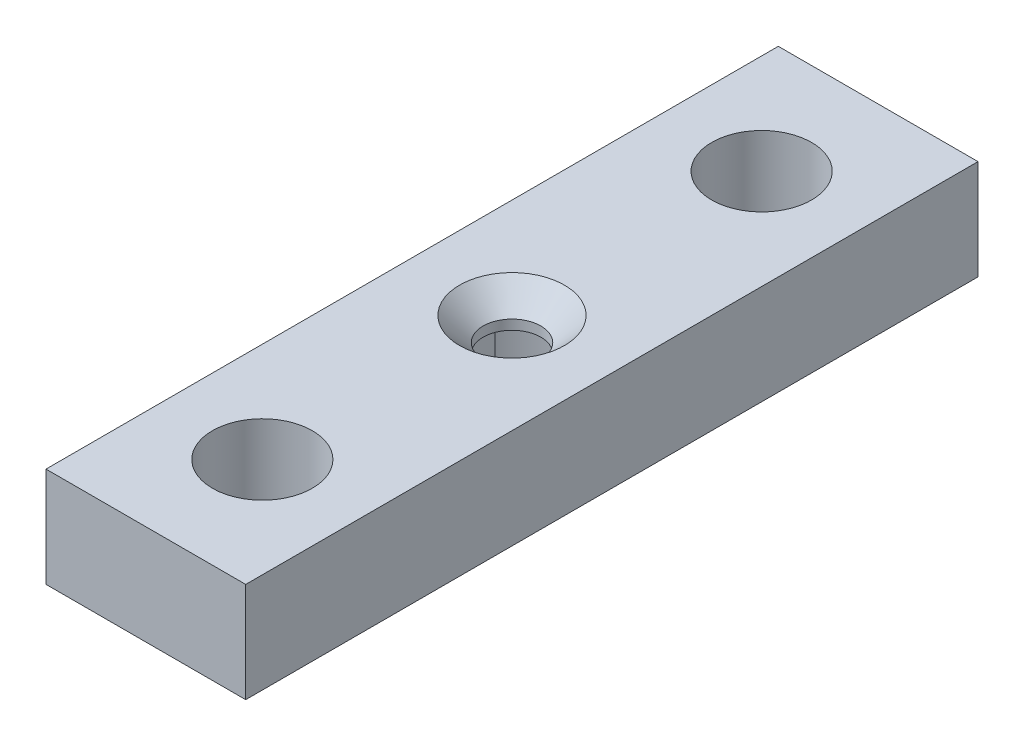
ISO-10303-21;
HEADER;
FILE_DESCRIPTION(('STEP AP214'),'2;1');
FILE_NAME('part.step','',(''),(''),'','','');
FILE_SCHEMA(('AUTOMOTIVE_DESIGN { 1 0 10303 214 1 1 1 1 }'));
ENDSEC;
DATA;
#1=APPLICATION_CONTEXT('core data for automotive mechanical design processes');
#2=APPLICATION_PROTOCOL_DEFINITION('international standard','automotive_design',2000,#1);
#3=PRODUCT_CONTEXT('',#1,'mechanical');
#4=PRODUCT('Part','Part','',(#3));
#5=PRODUCT_RELATED_PRODUCT_CATEGORY('part','',(#4));
#6=PRODUCT_DEFINITION_FORMATION('','',#4);
#7=PRODUCT_DEFINITION_CONTEXT('part definition',#1,'design');
#8=PRODUCT_DEFINITION('design','',#6,#7);
#9=PRODUCT_DEFINITION_SHAPE('','',#8);
#10=(LENGTH_UNIT() NAMED_UNIT(*) SI_UNIT(.MILLI.,.METRE.));
#11=(NAMED_UNIT(*) PLANE_ANGLE_UNIT() SI_UNIT($,.RADIAN.));
#12=(NAMED_UNIT(*) SI_UNIT($,.STERADIAN.) SOLID_ANGLE_UNIT());
#13=UNCERTAINTY_MEASURE_WITH_UNIT(LENGTH_MEASURE(1.E-05),#10,'distance_accuracy_value','');
#14=(GEOMETRIC_REPRESENTATION_CONTEXT(3) GLOBAL_UNCERTAINTY_ASSIGNED_CONTEXT((#13)) GLOBAL_UNIT_ASSIGNED_CONTEXT((#10,
#11,#12)) REPRESENTATION_CONTEXT('',''));
#15=CARTESIAN_POINT('',(0.,0.,0.));
#16=DIRECTION('',(0.,0.,1.));
#17=DIRECTION('',(1.,0.,0.));
#18=AXIS2_PLACEMENT_3D('',#15,#16,#17);
#19=CARTESIAN_POINT('',(0.,3.175,0.));
#20=DIRECTION('',(0.,-1.,0.));
#21=DIRECTION('',(0.,0.,-1.));
#22=AXIS2_PLACEMENT_3D('',#19,#20,#21);
#23=CYLINDRICAL_SURFACE('',#22,15.9385);
#24=CARTESIAN_POINT('',(0.,-9.525,0.));
#25=DIRECTION('',(0.,-1.,0.));
#26=DIRECTION('',(0.,0.,-1.));
#27=AXIS2_PLACEMENT_3D('',#24,#25,#26);
#28=CIRCLE('',#27,15.9385);
#29=CARTESIAN_POINT('',(-12.7635,-9.525,-9.54614320026679));
#30=VERTEX_POINT('',#29);
#31=CARTESIAN_POINT('',(12.7635,-9.525,-9.54614320026679));
#32=VERTEX_POINT('',#31);
#33=EDGE_CURVE('E112',#30,#32,#28,.T.);
#34=ORIENTED_EDGE('',*,*,#33,.T.);
#35=DIRECTION('',(0.,-1.,0.));
#36=VECTOR('',#35,1.);
#37=CARTESIAN_POINT('',(12.7635,22.5294833307428,-9.54614320026679));
#38=LINE('',#37,#36);
#39=CARTESIAN_POINT('',(12.7635,3.175,-9.54614320026679));
#40=VERTEX_POINT('',#39);
#41=EDGE_CURVE('E58',#40,#32,#38,.T.);
#42=ORIENTED_EDGE('',*,*,#41,.F.);
#43=CARTESIAN_POINT('',(0.,3.175,0.));
#44=DIRECTION('',(0.,-1.,0.));
#45=DIRECTION('',(0.,0.,-1.));
#46=AXIS2_PLACEMENT_3D('',#43,#44,#45);
#47=CIRCLE('',#46,15.9385);
#48=CARTESIAN_POINT('',(-12.7635,3.175,-9.54614320026679));
#49=VERTEX_POINT('',#48);
#50=EDGE_CURVE('E133',#49,#40,#47,.T.);
#51=ORIENTED_EDGE('',*,*,#50,.F.);
#52=DIRECTION('',(0.,-1.,0.));
#53=VECTOR('',#52,1.);
#54=CARTESIAN_POINT('',(-12.7635,22.5294833307428,-9.54614320026679));
#55=LINE('',#54,#53);
#56=EDGE_CURVE('E127',#49,#30,#55,.T.);
#57=ORIENTED_EDGE('',*,*,#56,.T.);
#58=EDGE_LOOP('',(#34,#42,#51,#57));
#59=FACE_BOUND('',#58,.T.);
#60=ADVANCED_FACE('F34',(#59),#23,.F.);
#61=CARTESIAN_POINT('',(0.,9.525,0.));
#62=DIRECTION('',(0.,1.,0.));
#63=DIRECTION('',(0.,0.,1.));
#64=AXIS2_PLACEMENT_3D('',#61,#62,#63);
#65=CYLINDRICAL_SURFACE('',#64,5.49999999999999);
#66=CARTESIAN_POINT('',(0.,5.025,0.));
#67=DIRECTION('',(0.,1.,0.));
#68=DIRECTION('',(0.,0.,1.));
#69=AXIS2_PLACEMENT_3D('',#66,#67,#68);
#70=CIRCLE('',#69,5.5);
#71=CARTESIAN_POINT('',(0.,5.025,5.5));
#72=VERTEX_POINT('',#71);
#73=EDGE_CURVE('E138',#72,#72,#70,.T.);
#74=ORIENTED_EDGE('',*,*,#73,.T.);
#75=EDGE_LOOP('',(#74));
#76=FACE_BOUND('',#75,.T.);
#77=CARTESIAN_POINT('',(0.,3.175,0.));
#78=DIRECTION('',(0.,-1.,0.));
#79=DIRECTION('',(0.,0.,-1.));
#80=AXIS2_PLACEMENT_3D('',#77,#78,#79);
#81=CIRCLE('',#80,5.49999999999999);
#82=CARTESIAN_POINT('',(0.,3.175,-5.49999999999999));
#83=VERTEX_POINT('',#82);
#84=EDGE_CURVE('E38',#83,#83,#81,.F.);
#85=ORIENTED_EDGE('',*,*,#84,.F.);
#86=EDGE_LOOP('',(#85));
#87=FACE_BOUND('',#86,.T.);
#88=ADVANCED_FACE('F205',(#76,#87),#65,.F.);
#89=CARTESIAN_POINT('',(19.05,9.525,69.85));
#90=DIRECTION('',(-1.,0.,0.));
#91=DIRECTION('',(0.,-1.,0.));
#92=AXIS2_PLACEMENT_3D('',#89,#90,#91);
#93=PLANE('',#92);
#94=DIRECTION('',(0.,1.,0.));
#95=VECTOR('',#94,1.);
#96=CARTESIAN_POINT('',(19.05,9.525,-69.85));
#97=LINE('',#96,#95);
#98=CARTESIAN_POINT('',(19.05,-9.525,-69.85));
#99=VERTEX_POINT('',#98);
#100=CARTESIAN_POINT('',(19.05,9.525,-69.85));
#101=VERTEX_POINT('',#100);
#102=EDGE_CURVE('E149',#99,#101,#97,.T.);
#103=ORIENTED_EDGE('',*,*,#102,.T.);
#104=DIRECTION('',(0.,0.,-1.));
#105=VECTOR('',#104,1.);
#106=CARTESIAN_POINT('',(19.05,9.525,69.85));
#107=LINE('',#106,#105);
#108=CARTESIAN_POINT('',(19.05,9.525,69.85));
#109=VERTEX_POINT('',#108);
#110=EDGE_CURVE('E11',#109,#101,#107,.T.);
#111=ORIENTED_EDGE('',*,*,#110,.F.);
#112=DIRECTION('',(0.,1.,0.));
#113=VECTOR('',#112,1.);
#114=CARTESIAN_POINT('',(19.05,9.525,69.85));
#115=LINE('',#114,#113);
#116=CARTESIAN_POINT('',(19.05,-9.525,69.85));
#117=VERTEX_POINT('',#116);
#118=EDGE_CURVE('E154',#117,#109,#115,.T.);
#119=ORIENTED_EDGE('',*,*,#118,.F.);
#120=DIRECTION('',(0.,0.,-1.));
#121=VECTOR('',#120,1.);
#122=CARTESIAN_POINT('',(19.05,-9.525,69.85));
#123=LINE('',#122,#121);
#124=EDGE_CURVE('E164',#117,#99,#123,.T.);
#125=ORIENTED_EDGE('',*,*,#124,.T.);
#126=EDGE_LOOP('',(#103,#111,#119,#125));
#127=FACE_BOUND('',#126,.T.);
#128=ADVANCED_FACE('F36',(#127),#93,.F.);
#129=CARTESIAN_POINT('',(-19.05,9.525,69.85));
#130=DIRECTION('',(0.,-1.,0.));
#131=DIRECTION('',(0.,0.,-1.));
#132=AXIS2_PLACEMENT_3D('',#129,#130,#131);
#133=PLANE('',#132);
#134=CARTESIAN_POINT('',(0.,9.525,0.));
#135=DIRECTION('',(0.,1.,0.));
#136=DIRECTION('',(0.,0.,1.));
#137=AXIS2_PLACEMENT_3D('',#134,#135,#136);
#138=CIRCLE('',#137,10.);
#139=CARTESIAN_POINT('',(0.,9.525,10.));
#140=VERTEX_POINT('',#139);
#141=EDGE_CURVE('E135',#140,#140,#138,.T.);
#142=ORIENTED_EDGE('',*,*,#141,.F.);
#143=EDGE_LOOP('',(#142));
#144=FACE_BOUND('',#143,.T.);
#145=CARTESIAN_POINT('',(0.,9.525,-47.625));
#146=DIRECTION('',(0.,1.,0.));
#147=DIRECTION('',(0.,0.,1.));
#148=AXIS2_PLACEMENT_3D('',#145,#146,#147);
#149=CIRCLE('',#148,9.525);
#150=CARTESIAN_POINT('',(0.,9.525,-38.1));
#151=VERTEX_POINT('',#150);
#152=EDGE_CURVE('E142',#151,#151,#149,.T.);
#153=ORIENTED_EDGE('',*,*,#152,.F.);
#154=EDGE_LOOP('',(#153));
#155=FACE_BOUND('',#154,.T.);
#156=CARTESIAN_POINT('',(0.,9.525,47.625));
#157=DIRECTION('',(0.,1.,0.));
#158=DIRECTION('',(0.,0.,1.));
#159=AXIS2_PLACEMENT_3D('',#156,#157,#158);
#160=CIRCLE('',#159,9.525);
#161=CARTESIAN_POINT('',(0.,9.525,57.15));
#162=VERTEX_POINT('',#161);
#163=EDGE_CURVE('E141',#162,#162,#160,.T.);
#164=ORIENTED_EDGE('',*,*,#163,.F.);
#165=EDGE_LOOP('',(#164));
#166=FACE_BOUND('',#165,.T.);
#167=DIRECTION('',(-1.,0.,0.));
#168=VECTOR('',#167,1.);
#169=CARTESIAN_POINT('',(-19.05,9.525,-69.85));
#170=LINE('',#169,#168);
#171=CARTESIAN_POINT('',(-19.05,9.525,-69.85));
#172=VERTEX_POINT('',#171);
#173=EDGE_CURVE('E167',#101,#172,#170,.T.);
#174=ORIENTED_EDGE('',*,*,#173,.T.);
#175=DIRECTION('',(0.,0.,-1.));
#176=VECTOR('',#175,1.);
#177=CARTESIAN_POINT('',(-19.05,9.525,69.85));
#178=LINE('',#177,#176);
#179=CARTESIAN_POINT('',(-19.05,9.525,69.85));
#180=VERTEX_POINT('',#179);
#181=EDGE_CURVE('E43',#180,#172,#178,.T.);
#182=ORIENTED_EDGE('',*,*,#181,.F.);
#183=DIRECTION('',(-1.,0.,0.));
#184=VECTOR('',#183,1.);
#185=CARTESIAN_POINT('',(-19.05,9.525,69.85));
#186=LINE('',#185,#184);
#187=EDGE_CURVE('E157',#109,#180,#186,.T.);
#188=ORIENTED_EDGE('',*,*,#187,.F.);
#189=ORIENTED_EDGE('',*,*,#110,.T.);
#190=EDGE_LOOP('',(#174,#182,#188,#189));
#191=FACE_BOUND('',#190,.T.);
#192=ADVANCED_FACE('F197',(#144,#155,#166,#191),#133,.F.);
#193=CARTESIAN_POINT('',(-19.05,9.525,69.85));
#194=DIRECTION('',(1.,0.,0.));
#195=DIRECTION('',(0.,1.,0.));
#196=AXIS2_PLACEMENT_3D('',#193,#194,#195);
#197=PLANE('',#196);
#198=DIRECTION('',(0.,-1.,0.));
#199=VECTOR('',#198,1.);
#200=CARTESIAN_POINT('',(-19.05,9.525,-69.85));
#201=LINE('',#200,#199);
#202=CARTESIAN_POINT('',(-19.05,-9.525,-69.85));
#203=VERTEX_POINT('',#202);
#204=EDGE_CURVE('E169',#172,#203,#201,.T.);
#205=ORIENTED_EDGE('',*,*,#204,.T.);
#206=DIRECTION('',(0.,0.,-1.));
#207=VECTOR('',#206,1.);
#208=CARTESIAN_POINT('',(-19.05,-9.525,69.85));
#209=LINE('',#208,#207);
#210=CARTESIAN_POINT('',(-19.05,-9.525,69.85));
#211=VERTEX_POINT('',#210);
#212=EDGE_CURVE('E174',#211,#203,#209,.T.);
#213=ORIENTED_EDGE('',*,*,#212,.F.);
#214=DIRECTION('',(0.,-1.,0.));
#215=VECTOR('',#214,1.);
#216=CARTESIAN_POINT('',(-19.05,9.525,69.85));
#217=LINE('',#216,#215);
#218=EDGE_CURVE('E160',#180,#211,#217,.T.);
#219=ORIENTED_EDGE('',*,*,#218,.F.);
#220=ORIENTED_EDGE('',*,*,#181,.T.);
#221=EDGE_LOOP('',(#205,#213,#219,#220));
#222=FACE_BOUND('',#221,.T.);
#223=ADVANCED_FACE('F182',(#222),#197,.F.);
#224=CARTESIAN_POINT('',(-19.05,-9.525,69.85));
#225=DIRECTION('',(0.,1.,0.));
#226=DIRECTION('',(0.,0.,1.));
#227=AXIS2_PLACEMENT_3D('',#224,#225,#226);
#228=PLANE('',#227);
#229=ORIENTED_EDGE('',*,*,#33,.F.);
#230=DIRECTION('',(0.,0.,1.));
#231=VECTOR('',#230,1.);
#232=CARTESIAN_POINT('',(-12.7635,-9.525,9.54614320026679));
#233=LINE('',#232,#231);
#234=CARTESIAN_POINT('',(-12.7635,-9.525,9.54614320026679));
#235=VERTEX_POINT('',#234);
#236=EDGE_CURVE('E108',#30,#235,#233,.T.);
#237=ORIENTED_EDGE('',*,*,#236,.T.);
#238=CARTESIAN_POINT('',(12.7635,-9.525,9.54614320026679));
#239=VERTEX_POINT('',#238);
#240=EDGE_CURVE('E101',#239,#235,#28,.T.);
#241=ORIENTED_EDGE('',*,*,#240,.F.);
#242=DIRECTION('',(0.,0.,-1.));
#243=VECTOR('',#242,1.);
#244=CARTESIAN_POINT('',(12.7635,-9.525,9.54614320026679));
#245=LINE('',#244,#243);
#246=EDGE_CURVE('E106',#239,#32,#245,.T.);
#247=ORIENTED_EDGE('',*,*,#246,.T.);
#248=EDGE_LOOP('',(#229,#237,#241,#247));
#249=FACE_BOUND('',#248,.T.);
#250=CARTESIAN_POINT('',(0.,-9.525,-47.625));
#251=DIRECTION('',(0.,1.,0.));
#252=DIRECTION('',(0.,0.,1.));
#253=AXIS2_PLACEMENT_3D('',#250,#251,#252);
#254=CIRCLE('',#253,9.525);
#255=CARTESIAN_POINT('',(0.,-9.525,-38.1));
#256=VERTEX_POINT('',#255);
#257=EDGE_CURVE('E145',#256,#256,#254,.F.);
#258=ORIENTED_EDGE('',*,*,#257,.F.);
#259=EDGE_LOOP('',(#258));
#260=FACE_BOUND('',#259,.T.);
#261=CARTESIAN_POINT('',(0.,-9.525,47.625));
#262=DIRECTION('',(0.,1.,0.));
#263=DIRECTION('',(0.,0.,1.));
#264=AXIS2_PLACEMENT_3D('',#261,#262,#263);
#265=CIRCLE('',#264,9.525);
#266=CARTESIAN_POINT('',(0.,-9.525,57.15));
#267=VERTEX_POINT('',#266);
#268=EDGE_CURVE('E146',#267,#267,#265,.F.);
#269=ORIENTED_EDGE('',*,*,#268,.F.);
#270=EDGE_LOOP('',(#269));
#271=FACE_BOUND('',#270,.T.);
#272=DIRECTION('',(1.,0.,0.));
#273=VECTOR('',#272,1.);
#274=CARTESIAN_POINT('',(-19.05,-9.525,-69.85));
#275=LINE('',#274,#273);
#276=EDGE_CURVE('E158',#203,#99,#275,.T.);
#277=ORIENTED_EDGE('',*,*,#276,.T.);
#278=ORIENTED_EDGE('',*,*,#124,.F.);
#279=DIRECTION('',(1.,0.,0.));
#280=VECTOR('',#279,1.);
#281=CARTESIAN_POINT('',(-19.05,-9.525,69.85));
#282=LINE('',#281,#280);
#283=EDGE_CURVE('E162',#211,#117,#282,.T.);
#284=ORIENTED_EDGE('',*,*,#283,.F.);
#285=ORIENTED_EDGE('',*,*,#212,.T.);
#286=EDGE_LOOP('',(#277,#278,#284,#285));
#287=FACE_BOUND('',#286,.T.);
#288=ADVANCED_FACE('F103',(#249,#260,#271,#287),#228,.F.);
#289=CARTESIAN_POINT('',(19.05,-9.525,69.85));
#290=DIRECTION('',(0.,0.,1.));
#291=DIRECTION('',(1.,0.,0.));
#292=AXIS2_PLACEMENT_3D('',#289,#290,#291);
#293=PLANE('',#292);
#294=ORIENTED_EDGE('',*,*,#118,.T.);
#295=ORIENTED_EDGE('',*,*,#187,.T.);
#296=ORIENTED_EDGE('',*,*,#218,.T.);
#297=ORIENTED_EDGE('',*,*,#283,.T.);
#298=EDGE_LOOP('',(#294,#295,#296,#297));
#299=FACE_BOUND('',#298,.T.);
#300=ADVANCED_FACE('F196',(#299),#293,.T.);
#301=CARTESIAN_POINT('',(19.05,-9.525,-69.85));
#302=DIRECTION('',(0.,0.,1.));
#303=DIRECTION('',(1.,0.,0.));
#304=AXIS2_PLACEMENT_3D('',#301,#302,#303);
#305=PLANE('',#304);
#306=ORIENTED_EDGE('',*,*,#102,.F.);
#307=ORIENTED_EDGE('',*,*,#276,.F.);
#308=ORIENTED_EDGE('',*,*,#204,.F.);
#309=ORIENTED_EDGE('',*,*,#173,.F.);
#310=EDGE_LOOP('',(#306,#307,#308,#309));
#311=FACE_BOUND('',#310,.T.);
#312=ADVANCED_FACE('F188',(#311),#305,.F.);
#313=CARTESIAN_POINT('',(0.,-9.526,47.625));
#314=DIRECTION('',(0.,1.,0.));
#315=DIRECTION('',(0.,0.,1.));
#316=AXIS2_PLACEMENT_3D('',#313,#314,#315);
#317=CYLINDRICAL_SURFACE('',#316,9.525);
#318=ORIENTED_EDGE('',*,*,#163,.T.);
#319=EDGE_LOOP('',(#318));
#320=FACE_BOUND('',#319,.T.);
#321=ORIENTED_EDGE('',*,*,#268,.T.);
#322=EDGE_LOOP('',(#321));
#323=FACE_BOUND('',#322,.T.);
#324=ADVANCED_FACE('F290',(#320,#323),#317,.F.);
#325=CARTESIAN_POINT('',(0.,-9.526,-47.625));
#326=DIRECTION('',(0.,1.,0.));
#327=DIRECTION('',(0.,0.,1.));
#328=AXIS2_PLACEMENT_3D('',#325,#326,#327);
#329=CYLINDRICAL_SURFACE('',#328,9.525);
#330=ORIENTED_EDGE('',*,*,#152,.T.);
#331=EDGE_LOOP('',(#330));
#332=FACE_BOUND('',#331,.T.);
#333=ORIENTED_EDGE('',*,*,#257,.T.);
#334=EDGE_LOOP('',(#333));
#335=FACE_BOUND('',#334,.T.);
#336=ADVANCED_FACE('F230',(#332,#335),#329,.F.);
#337=CARTESIAN_POINT('',(0.,9.525,0.));
#338=DIRECTION('',(0.,1.,0.));
#339=DIRECTION('',(0.,0.,1.));
#340=AXIS2_PLACEMENT_3D('',#337,#338,#339);
#341=CONICAL_SURFACE('',#340,10.,0.785398163397449);
#342=ORIENTED_EDGE('',*,*,#73,.F.);
#343=EDGE_LOOP('',(#342));
#344=FACE_BOUND('',#343,.T.);
#345=ORIENTED_EDGE('',*,*,#141,.T.);
#346=EDGE_LOOP('',(#345));
#347=FACE_BOUND('',#346,.T.);
#348=ADVANCED_FACE('F226',(#344,#347),#341,.F.);
#349=CARTESIAN_POINT('',(0.,3.175,0.));
#350=DIRECTION('',(0.,-1.,0.));
#351=DIRECTION('',(0.,0.,-1.));
#352=AXIS2_PLACEMENT_3D('',#349,#350,#351);
#353=PLANE('',#352);
#354=DIRECTION('',(0.,0.,1.));
#355=VECTOR('',#354,1.);
#356=CARTESIAN_POINT('',(12.7635,3.175,9.54614320026679));
#357=LINE('',#356,#355);
#358=CARTESIAN_POINT('',(12.7635,3.175,9.54614320026679));
#359=VERTEX_POINT('',#358);
#360=EDGE_CURVE('E50',#40,#359,#357,.T.);
#361=ORIENTED_EDGE('',*,*,#360,.T.);
#362=CARTESIAN_POINT('',(-12.7635,3.175,9.54614320026679));
#363=VERTEX_POINT('',#362);
#364=EDGE_CURVE('E118',#359,#363,#47,.T.);
#365=ORIENTED_EDGE('',*,*,#364,.T.);
#366=DIRECTION('',(0.,0.,-1.));
#367=VECTOR('',#366,1.);
#368=CARTESIAN_POINT('',(-12.7635,3.175,9.54614320026679));
#369=LINE('',#368,#367);
#370=EDGE_CURVE('E113',#363,#49,#369,.T.);
#371=ORIENTED_EDGE('',*,*,#370,.T.);
#372=ORIENTED_EDGE('',*,*,#50,.T.);
#373=EDGE_LOOP('',(#361,#365,#371,#372));
#374=FACE_BOUND('',#373,.T.);
#375=ORIENTED_EDGE('',*,*,#84,.T.);
#376=EDGE_LOOP('',(#375));
#377=FACE_BOUND('',#376,.T.);
#378=ADVANCED_FACE('F219',(#374,#377),#353,.T.);
#379=ORIENTED_EDGE('',*,*,#364,.F.);
#380=DIRECTION('',(0.,-1.,0.));
#381=VECTOR('',#380,1.);
#382=CARTESIAN_POINT('',(12.7635,22.5294833307428,9.54614320026679));
#383=LINE('',#382,#381);
#384=EDGE_CURVE('E116',#359,#239,#383,.T.);
#385=ORIENTED_EDGE('',*,*,#384,.T.);
#386=ORIENTED_EDGE('',*,*,#240,.T.);
#387=DIRECTION('',(0.,-1.,0.));
#388=VECTOR('',#387,1.);
#389=CARTESIAN_POINT('',(-12.7635,22.5294833307428,9.54614320026679));
#390=LINE('',#389,#388);
#391=EDGE_CURVE('E128',#363,#235,#390,.T.);
#392=ORIENTED_EDGE('',*,*,#391,.F.);
#393=EDGE_LOOP('',(#379,#385,#386,#392));
#394=FACE_BOUND('',#393,.T.);
#395=ADVANCED_FACE('F117',(#394),#23,.F.);
#396=CARTESIAN_POINT('',(-12.7635,22.5294833307428,9.54614320026679));
#397=DIRECTION('',(1.,0.,0.));
#398=DIRECTION('',(0.,0.,-1.));
#399=AXIS2_PLACEMENT_3D('',#396,#397,#398);
#400=PLANE('',#399);
#401=ORIENTED_EDGE('',*,*,#370,.F.);
#402=ORIENTED_EDGE('',*,*,#391,.T.);
#403=ORIENTED_EDGE('',*,*,#236,.F.);
#404=ORIENTED_EDGE('',*,*,#56,.F.);
#405=EDGE_LOOP('',(#401,#402,#403,#404));
#406=FACE_BOUND('',#405,.T.);
#407=ADVANCED_FACE('F218',(#406),#400,.T.);
#408=CARTESIAN_POINT('',(12.7635,22.5294833307428,9.54614320026679));
#409=DIRECTION('',(-1.,0.,0.));
#410=DIRECTION('',(0.,0.,1.));
#411=AXIS2_PLACEMENT_3D('',#408,#409,#410);
#412=PLANE('',#411);
#413=ORIENTED_EDGE('',*,*,#360,.F.);
#414=ORIENTED_EDGE('',*,*,#41,.T.);
#415=ORIENTED_EDGE('',*,*,#246,.F.);
#416=ORIENTED_EDGE('',*,*,#384,.F.);
#417=EDGE_LOOP('',(#413,#414,#415,#416));
#418=FACE_BOUND('',#417,.T.);
#419=ADVANCED_FACE('F121',(#418),#412,.T.);
#420=CLOSED_SHELL('',(#60,#88,#128,#192,#223,#288,#300,#312,#324,#336,#348,#378,#395,#407,#419));
#421=MANIFOLD_SOLID_BREP('B2',#420);
#422=ADVANCED_BREP_SHAPE_REPRESENTATION('',(#18,#421),#14);
#423=SHAPE_DEFINITION_REPRESENTATION(#9,#422);
ENDSEC;
END-ISO-10303-21;
